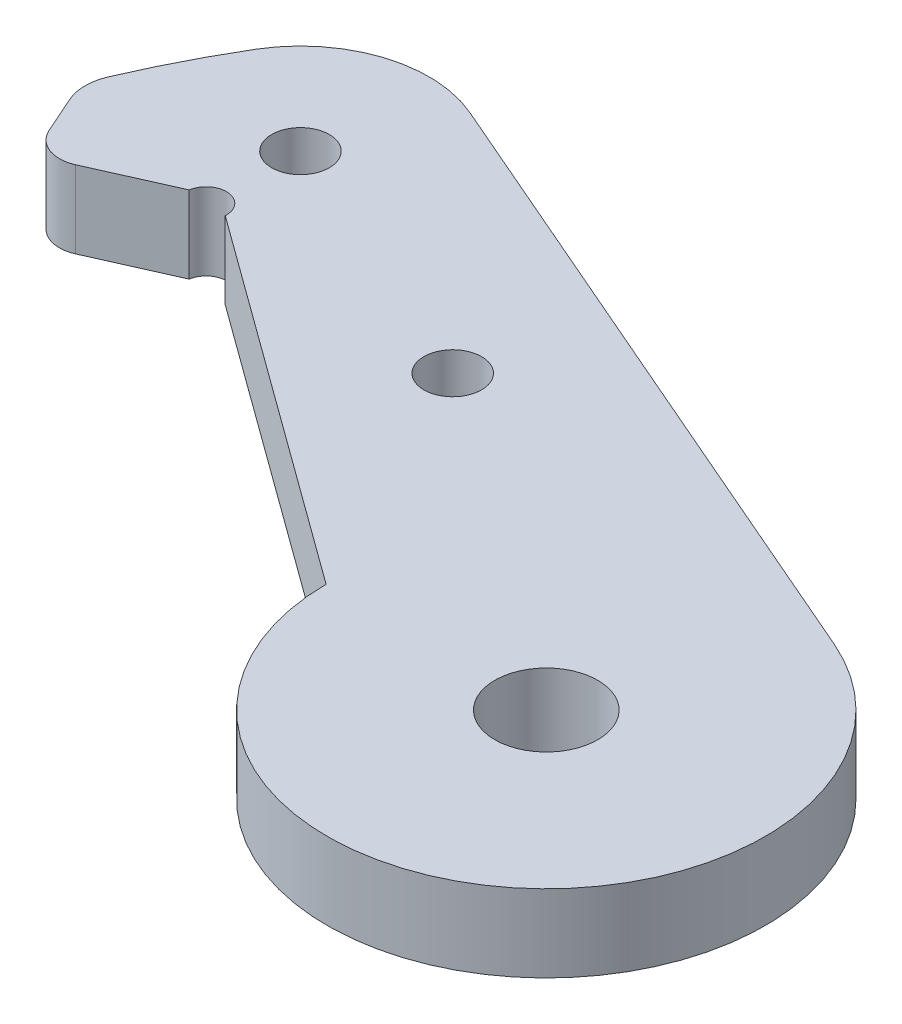
ISO-10303-21;
HEADER;
FILE_DESCRIPTION(('STEP AP214'),'2;1');
FILE_NAME('part.step','',(''),(''),'','','');
FILE_SCHEMA(('AUTOMOTIVE_DESIGN { 1 0 10303 214 1 1 1 1 }'));
ENDSEC;
DATA;
#1=APPLICATION_CONTEXT('core data for automotive mechanical design processes');
#2=APPLICATION_PROTOCOL_DEFINITION('international standard','automotive_design',2000,#1);
#3=PRODUCT_CONTEXT('',#1,'mechanical');
#4=PRODUCT('Part','Part','',(#3));
#5=PRODUCT_RELATED_PRODUCT_CATEGORY('part','',(#4));
#6=PRODUCT_DEFINITION_FORMATION('','',#4);
#7=PRODUCT_DEFINITION_CONTEXT('part definition',#1,'design');
#8=PRODUCT_DEFINITION('design','',#6,#7);
#9=PRODUCT_DEFINITION_SHAPE('','',#8);
#10=(LENGTH_UNIT() NAMED_UNIT(*) SI_UNIT(.MILLI.,.METRE.));
#11=(NAMED_UNIT(*) PLANE_ANGLE_UNIT() SI_UNIT($,.RADIAN.));
#12=(NAMED_UNIT(*) SI_UNIT($,.STERADIAN.) SOLID_ANGLE_UNIT());
#13=UNCERTAINTY_MEASURE_WITH_UNIT(LENGTH_MEASURE(1.E-05),#10,'distance_accuracy_value','');
#14=(GEOMETRIC_REPRESENTATION_CONTEXT(3) GLOBAL_UNCERTAINTY_ASSIGNED_CONTEXT((#13)) GLOBAL_UNIT_ASSIGNED_CONTEXT((#10,
#11,#12)) REPRESENTATION_CONTEXT('',''));
#15=CARTESIAN_POINT('',(0.,0.,0.));
#16=DIRECTION('',(0.,0.,1.));
#17=DIRECTION('',(1.,0.,0.));
#18=AXIS2_PLACEMENT_3D('',#15,#16,#17);
#19=CARTESIAN_POINT('',(-44.4381463641511,4.7625,-16.4261833639371));
#20=DIRECTION('',(0.,-1.,0.));
#21=DIRECTION('',(0.,0.,-1.));
#22=AXIS2_PLACEMENT_3D('',#19,#20,#21);
#23=PLANE('',#22);
#24=CARTESIAN_POINT('',(-44.4381463641511,4.7625,-16.4261833639371));
#25=DIRECTION('',(0.,1.,0.));
#26=DIRECTION('',(0.,0.,-1.));
#27=AXIS2_PLACEMENT_3D('',#24,#25,#26);
#28=CIRCLE('',#27,2.);
#29=CARTESIAN_POINT('',(-46.2655823530906,4.7625,-15.6134855687334));
#30=VERTEX_POINT('',#29);
#31=CARTESIAN_POINT('',(-43.6254485689475,4.7625,-14.5987473749976));
#32=VERTEX_POINT('',#31);
#33=EDGE_CURVE('E171',#30,#32,#28,.T.);
#34=ORIENTED_EDGE('',*,*,#33,.T.);
#35=DIRECTION('',(0.913717994469729,0.,-0.406348897601823));
#36=VECTOR('',#35,1.);
#37=CARTESIAN_POINT('',(-38.7702250311405,4.7625,-16.7579636147339));
#38=LINE('',#37,#36);
#39=CARTESIAN_POINT('',(-38.7702250311405,4.7625,-16.7579636147339));
#40=VERTEX_POINT('',#39);
#41=EDGE_CURVE('E109',#32,#40,#38,.T.);
#42=ORIENTED_EDGE('',*,*,#41,.T.);
#43=CARTESIAN_POINT('',(-37.5347907026087,4.7625,-16.5676953307629));
#44=DIRECTION('',(0.,-1.,0.));
#45=DIRECTION('',(0.,0.,-1.));
#46=AXIS2_PLACEMENT_3D('',#43,#44,#45);
#47=CIRCLE('',#46,1.25);
#48=CARTESIAN_POINT('',(-36.2868550805044,4.7625,-16.4958852821415));
#49=VERTEX_POINT('',#48);
#50=EDGE_CURVE('E192',#40,#49,#47,.T.);
#51=ORIENTED_EDGE('',*,*,#50,.T.);
#52=DIRECTION('',(0.808767465357847,0.,0.588128546304839));
#53=VECTOR('',#52,1.);
#54=CARTESIAN_POINT('',(-36.2868550805044,4.7625,-16.4958852821415));
#55=LINE('',#54,#53);
#56=CARTESIAN_POINT('',(-13.4997935259034,4.7625,0.074664301893318));
#57=VERTEX_POINT('',#56);
#58=EDGE_CURVE('E211',#49,#57,#55,.T.);
#59=ORIENTED_EDGE('',*,*,#58,.T.);
#60=CARTESIAN_POINT('',(0.,4.7625,0.));
#61=DIRECTION('',(0.,1.,0.));
#62=DIRECTION('',(0.,0.,1.));
#63=AXIS2_PLACEMENT_3D('',#60,#61,#62);
#64=CIRCLE('',#63,13.5);
#65=CARTESIAN_POINT('',(5.36363887672502,4.7625,-12.3887601478148));
#66=VERTEX_POINT('',#65);
#67=EDGE_CURVE('E208',#57,#66,#64,.T.);
#68=ORIENTED_EDGE('',*,*,#67,.T.);
#69=DIRECTION('',(-0.917685936875169,0.,-0.397306583461113));
#70=VECTOR('',#69,1.);
#71=CARTESIAN_POINT('',(-34.2596328863461,4.7625,-29.5434163293646));
#72=LINE('',#71,#70);
#73=CARTESIAN_POINT('',(-34.2596328863461,4.7625,-29.5434163293646));
#74=VERTEX_POINT('',#73);
#75=EDGE_CURVE('E210',#66,#74,#72,.T.);
#76=ORIENTED_EDGE('',*,*,#75,.T.);
#77=CARTESIAN_POINT('',(-37.4132538925687,4.7625,-22.2592842054179));
#78=DIRECTION('',(0.,1.,0.));
#79=DIRECTION('',(0.,0.,1.));
#80=AXIS2_PLACEMENT_3D('',#77,#78,#79);
#81=CIRCLE('',#80,7.93750000000001);
#82=CARTESIAN_POINT('',(-44.234733224639,4.7625,-26.3177723441387));
#83=VERTEX_POINT('',#82);
#84=EDGE_CURVE('E134',#74,#83,#81,.T.);
#85=ORIENTED_EDGE('',*,*,#84,.T.);
#86=CARTESIAN_POINT('',(0.,4.7625,0.));
#87=DIRECTION('',(0.,1.,0.));
#88=DIRECTION('',(0.,0.,-1.));
#89=AXIS2_PLACEMENT_3D('',#86,#87,#88);
#90=CIRCLE('',#89,51.4717083902691);
#91=CARTESIAN_POINT('',(-47.2982832858306,4.7625,-20.3029348328316));
#92=VERTEX_POINT('',#91);
#93=EDGE_CURVE('E128',#83,#92,#90,.T.);
#94=ORIENTED_EDGE('',*,*,#93,.T.);
#95=CARTESIAN_POINT('',(-44.5415290553004,4.7625,-19.1195895271606));
#96=DIRECTION('',(0.,1.,0.));
#97=DIRECTION('',(0.,0.,1.));
#98=AXIS2_PLACEMENT_3D('',#95,#96,#97);
#99=CIRCLE('',#98,3.);
#100=CARTESIAN_POINT('',(-47.2826830387096,4.7625,-17.9005428343551));
#101=VERTEX_POINT('',#100);
#102=EDGE_CURVE('E132',#92,#101,#99,.T.);
#103=ORIENTED_EDGE('',*,*,#102,.T.);
#104=DIRECTION('',(0.406348897601824,0.,0.913717994469728));
#105=VECTOR('',#104,1.);
#106=CARTESIAN_POINT('',(-46.2655823530906,4.7625,-15.6134855687334));
#107=LINE('',#106,#105);
#108=EDGE_CURVE('E60',#101,#30,#107,.T.);
#109=ORIENTED_EDGE('',*,*,#108,.T.);
#110=EDGE_LOOP('',(#34,#42,#51,#59,#68,#76,#85,#94,#103,#109));
#111=FACE_BOUND('',#110,.T.);
#112=CARTESIAN_POINT('',(-20.8624589223986,4.7625,-15.0937174914343));
#113=DIRECTION('',(0.,1.,0.));
#114=DIRECTION('',(0.,0.,1.));
#115=AXIS2_PLACEMENT_3D('',#112,#113,#114);
#116=CIRCLE('',#115,1.778);
#117=CARTESIAN_POINT('',(-20.8624589223986,4.7625,-13.3157174914343));
#118=VERTEX_POINT('',#117);
#119=EDGE_CURVE('E156',#118,#118,#116,.T.);
#120=ORIENTED_EDGE('',*,*,#119,.F.);
#121=EDGE_LOOP('',(#120));
#122=FACE_BOUND('',#121,.T.);
#123=CARTESIAN_POINT('',(0.,4.7625,0.));
#124=DIRECTION('',(0.,1.,0.));
#125=DIRECTION('',(0.,0.,1.));
#126=AXIS2_PLACEMENT_3D('',#123,#124,#125);
#127=CIRCLE('',#126,3.175);
#128=CARTESIAN_POINT('',(0.,4.7625,3.175));
#129=VERTEX_POINT('',#128);
#130=EDGE_CURVE('E222',#129,#129,#127,.T.);
#131=ORIENTED_EDGE('',*,*,#130,.F.);
#132=EDGE_LOOP('',(#131));
#133=FACE_BOUND('',#132,.T.);
#134=CARTESIAN_POINT('',(-37.4132538925687,4.7625,-22.2592842054179));
#135=DIRECTION('',(0.,1.,0.));
#136=DIRECTION('',(0.,0.,1.));
#137=AXIS2_PLACEMENT_3D('',#134,#135,#136);
#138=CIRCLE('',#137,1.778);
#139=CARTESIAN_POINT('',(-37.4132538925687,4.7625,-20.4812842054179));
#140=VERTEX_POINT('',#139);
#141=EDGE_CURVE('E228',#140,#140,#138,.T.);
#142=ORIENTED_EDGE('',*,*,#141,.F.);
#143=EDGE_LOOP('',(#142));
#144=FACE_BOUND('',#143,.T.);
#145=ADVANCED_FACE('F43',(#111,#122,#133,#144),#23,.F.);
#146=CARTESIAN_POINT('',(-44.4381463641511,0.,-16.4261833639371));
#147=DIRECTION('',(0.,-1.,0.));
#148=DIRECTION('',(0.,0.,-1.));
#149=AXIS2_PLACEMENT_3D('',#146,#147,#148);
#150=PLANE('',#149);
#151=CARTESIAN_POINT('',(0.,0.,0.));
#152=DIRECTION('',(0.,1.,0.));
#153=DIRECTION('',(0.,0.,1.));
#154=AXIS2_PLACEMENT_3D('',#151,#152,#153);
#155=CIRCLE('',#154,3.175);
#156=CARTESIAN_POINT('',(0.,0.,3.175));
#157=VERTEX_POINT('',#156);
#158=EDGE_CURVE('E225',#157,#157,#155,.T.);
#159=ORIENTED_EDGE('',*,*,#158,.T.);
#160=EDGE_LOOP('',(#159));
#161=FACE_BOUND('',#160,.T.);
#162=CARTESIAN_POINT('',(-44.4381463641511,0.,-16.4261833639371));
#163=DIRECTION('',(0.,1.,0.));
#164=DIRECTION('',(0.,0.,-1.));
#165=AXIS2_PLACEMENT_3D('',#162,#163,#164);
#166=CIRCLE('',#165,2.);
#167=CARTESIAN_POINT('',(-46.2655823530906,0.,-15.6134855687334));
#168=VERTEX_POINT('',#167);
#169=CARTESIAN_POINT('',(-43.6254485689475,0.,-14.5987473749976));
#170=VERTEX_POINT('',#169);
#171=EDGE_CURVE('E152',#168,#170,#166,.T.);
#172=ORIENTED_EDGE('',*,*,#171,.F.);
#173=DIRECTION('',(0.406348897601824,0.,0.913717994469728));
#174=VECTOR('',#173,1.);
#175=CARTESIAN_POINT('',(-46.2655823530906,0.,-15.6134855687334));
#176=LINE('',#175,#174);
#177=CARTESIAN_POINT('',(-47.2826830387096,0.,-17.9005428343551));
#178=VERTEX_POINT('',#177);
#179=EDGE_CURVE('E101',#178,#168,#176,.T.);
#180=ORIENTED_EDGE('',*,*,#179,.F.);
#181=CARTESIAN_POINT('',(-44.5415290553004,0.,-19.1195895271606));
#182=DIRECTION('',(0.,1.,0.));
#183=DIRECTION('',(0.,0.,1.));
#184=AXIS2_PLACEMENT_3D('',#181,#182,#183);
#185=CIRCLE('',#184,3.);
#186=CARTESIAN_POINT('',(-47.2982832858306,0.,-20.3029348328316));
#187=VERTEX_POINT('',#186);
#188=EDGE_CURVE('E95',#187,#178,#185,.T.);
#189=ORIENTED_EDGE('',*,*,#188,.F.);
#190=CARTESIAN_POINT('',(0.,0.,0.));
#191=DIRECTION('',(0.,1.,0.));
#192=DIRECTION('',(0.,0.,-1.));
#193=AXIS2_PLACEMENT_3D('',#190,#191,#192);
#194=CIRCLE('',#193,51.4717083902691);
#195=CARTESIAN_POINT('',(-44.234733224639,0.,-26.3177723441387));
#196=VERTEX_POINT('',#195);
#197=EDGE_CURVE('E142',#196,#187,#194,.T.);
#198=ORIENTED_EDGE('',*,*,#197,.F.);
#199=CARTESIAN_POINT('',(-37.4132538925687,0.,-22.2592842054179));
#200=DIRECTION('',(0.,1.,0.));
#201=DIRECTION('',(0.,0.,1.));
#202=AXIS2_PLACEMENT_3D('',#199,#200,#201);
#203=CIRCLE('',#202,7.93750000000001);
#204=CARTESIAN_POINT('',(-34.2596328863461,0.,-29.5434163293646));
#205=VERTEX_POINT('',#204);
#206=EDGE_CURVE('E166',#205,#196,#203,.T.);
#207=ORIENTED_EDGE('',*,*,#206,.F.);
#208=DIRECTION('',(-0.917685936875169,0.,-0.397306583461113));
#209=VECTOR('',#208,1.);
#210=CARTESIAN_POINT('',(-34.2596328863461,0.,-29.5434163293646));
#211=LINE('',#210,#209);
#212=CARTESIAN_POINT('',(5.36363887672502,0.,-12.3887601478148));
#213=VERTEX_POINT('',#212);
#214=EDGE_CURVE('E164',#213,#205,#211,.T.);
#215=ORIENTED_EDGE('',*,*,#214,.F.);
#216=CARTESIAN_POINT('',(0.,0.,0.));
#217=DIRECTION('',(0.,1.,0.));
#218=DIRECTION('',(0.,0.,1.));
#219=AXIS2_PLACEMENT_3D('',#216,#217,#218);
#220=CIRCLE('',#219,13.5);
#221=CARTESIAN_POINT('',(-13.4997935259034,0.,0.074664301893318));
#222=VERTEX_POINT('',#221);
#223=EDGE_CURVE('E162',#222,#213,#220,.T.);
#224=ORIENTED_EDGE('',*,*,#223,.F.);
#225=DIRECTION('',(0.808767465357847,0.,0.588128546304839));
#226=VECTOR('',#225,1.);
#227=CARTESIAN_POINT('',(-36.2868550805044,0.,-16.4958852821415));
#228=LINE('',#227,#226);
#229=CARTESIAN_POINT('',(-36.2868550805044,0.,-16.4958852821415));
#230=VERTEX_POINT('',#229);
#231=EDGE_CURVE('E160',#230,#222,#228,.T.);
#232=ORIENTED_EDGE('',*,*,#231,.F.);
#233=CARTESIAN_POINT('',(-37.5347907026087,0.,-16.5676953307629));
#234=DIRECTION('',(0.,-1.,0.));
#235=DIRECTION('',(0.,0.,-1.));
#236=AXIS2_PLACEMENT_3D('',#233,#234,#235);
#237=CIRCLE('',#236,1.25);
#238=CARTESIAN_POINT('',(-38.7702250311405,0.,-16.7579636147339));
#239=VERTEX_POINT('',#238);
#240=EDGE_CURVE('E158',#239,#230,#237,.T.);
#241=ORIENTED_EDGE('',*,*,#240,.F.);
#242=DIRECTION('',(0.913717994469729,0.,-0.406348897601823));
#243=VECTOR('',#242,1.);
#244=CARTESIAN_POINT('',(-38.7702250311405,0.,-16.7579636147339));
#245=LINE('',#244,#243);
#246=EDGE_CURVE('E155',#170,#239,#245,.T.);
#247=ORIENTED_EDGE('',*,*,#246,.F.);
#248=EDGE_LOOP('',(#172,#180,#189,#198,#207,#215,#224,#232,#241,#247));
#249=FACE_BOUND('',#248,.T.);
#250=CARTESIAN_POINT('',(-20.8624589223986,0.,-15.0937174914343));
#251=DIRECTION('',(0.,1.,0.));
#252=DIRECTION('',(0.,0.,1.));
#253=AXIS2_PLACEMENT_3D('',#250,#251,#252);
#254=CIRCLE('',#253,1.778);
#255=CARTESIAN_POINT('',(-20.8624589223986,0.,-13.3157174914343));
#256=VERTEX_POINT('',#255);
#257=EDGE_CURVE('E219',#256,#256,#254,.T.);
#258=ORIENTED_EDGE('',*,*,#257,.T.);
#259=EDGE_LOOP('',(#258));
#260=FACE_BOUND('',#259,.T.);
#261=CARTESIAN_POINT('',(-37.4132538925687,0.,-22.2592842054179));
#262=DIRECTION('',(0.,1.,0.));
#263=DIRECTION('',(0.,0.,1.));
#264=AXIS2_PLACEMENT_3D('',#261,#262,#263);
#265=CIRCLE('',#264,1.778);
#266=CARTESIAN_POINT('',(-37.4132538925687,0.,-20.4812842054179));
#267=VERTEX_POINT('',#266);
#268=EDGE_CURVE('E231',#267,#267,#265,.T.);
#269=ORIENTED_EDGE('',*,*,#268,.T.);
#270=EDGE_LOOP('',(#269));
#271=FACE_BOUND('',#270,.T.);
#272=ADVANCED_FACE('F196',(#161,#249,#260,#271),#150,.T.);
#273=CARTESIAN_POINT('',(-44.4381463641511,4.7625,-16.4261833639371));
#274=DIRECTION('',(0.,-1.,0.));
#275=DIRECTION('',(0.,0.,-1.));
#276=AXIS2_PLACEMENT_3D('',#273,#274,#275);
#277=CYLINDRICAL_SURFACE('',#276,2.);
#278=ORIENTED_EDGE('',*,*,#171,.T.);
#279=DIRECTION('',(0.,-1.,0.));
#280=VECTOR('',#279,1.);
#281=CARTESIAN_POINT('',(-43.6254485689475,4.7625,-14.5987473749976));
#282=LINE('',#281,#280);
#283=EDGE_CURVE('E13',#32,#170,#282,.T.);
#284=ORIENTED_EDGE('',*,*,#283,.F.);
#285=ORIENTED_EDGE('',*,*,#33,.F.);
#286=DIRECTION('',(0.,-1.,0.));
#287=VECTOR('',#286,1.);
#288=CARTESIAN_POINT('',(-46.2655823530906,4.7625,-15.6134855687334));
#289=LINE('',#288,#287);
#290=EDGE_CURVE('E148',#30,#168,#289,.T.);
#291=ORIENTED_EDGE('',*,*,#290,.T.);
#292=EDGE_LOOP('',(#278,#284,#285,#291));
#293=FACE_BOUND('',#292,.T.);
#294=ADVANCED_FACE('F45',(#293),#277,.T.);
#295=CARTESIAN_POINT('',(-38.7702250311405,4.7625,-16.7579636147339));
#296=DIRECTION('',(-0.406348897601823,0.,-0.913717994469729));
#297=DIRECTION('',(-0.913717994469729,0.,0.406348897601823));
#298=AXIS2_PLACEMENT_3D('',#295,#296,#297);
#299=PLANE('',#298);
#300=ORIENTED_EDGE('',*,*,#246,.T.);
#301=DIRECTION('',(0.,-1.,0.));
#302=VECTOR('',#301,1.);
#303=CARTESIAN_POINT('',(-38.7702250311405,4.7625,-16.7579636147339));
#304=LINE('',#303,#302);
#305=EDGE_CURVE('E52',#40,#239,#304,.T.);
#306=ORIENTED_EDGE('',*,*,#305,.F.);
#307=ORIENTED_EDGE('',*,*,#41,.F.);
#308=ORIENTED_EDGE('',*,*,#283,.T.);
#309=EDGE_LOOP('',(#300,#306,#307,#308));
#310=FACE_BOUND('',#309,.T.);
#311=ADVANCED_FACE('F271',(#310),#299,.F.);
#312=CARTESIAN_POINT('',(-37.5347907026087,4.7625,-16.5676953307629));
#313=DIRECTION('',(0.,-1.,0.));
#314=DIRECTION('',(0.,0.,-1.));
#315=AXIS2_PLACEMENT_3D('',#312,#313,#314);
#316=CYLINDRICAL_SURFACE('',#315,1.25);
#317=ORIENTED_EDGE('',*,*,#240,.T.);
#318=DIRECTION('',(0.,-1.,0.));
#319=VECTOR('',#318,1.);
#320=CARTESIAN_POINT('',(-36.2868550805044,4.7625,-16.4958852821415));
#321=LINE('',#320,#319);
#322=EDGE_CURVE('E184',#49,#230,#321,.T.);
#323=ORIENTED_EDGE('',*,*,#322,.F.);
#324=ORIENTED_EDGE('',*,*,#50,.F.);
#325=ORIENTED_EDGE('',*,*,#305,.T.);
#326=EDGE_LOOP('',(#317,#323,#324,#325));
#327=FACE_BOUND('',#326,.T.);
#328=ADVANCED_FACE('F190',(#327),#316,.F.);
#329=CARTESIAN_POINT('',(-36.2868550805044,4.7625,-16.4958852821415));
#330=DIRECTION('',(0.588128546304839,0.,-0.808767465357847));
#331=DIRECTION('',(-0.808767465357847,0.,-0.588128546304839));
#332=AXIS2_PLACEMENT_3D('',#329,#330,#331);
#333=PLANE('',#332);
#334=ORIENTED_EDGE('',*,*,#231,.T.);
#335=DIRECTION('',(0.,-1.,0.));
#336=VECTOR('',#335,1.);
#337=CARTESIAN_POINT('',(-13.4997935259034,4.7625,0.074664301893318));
#338=LINE('',#337,#336);
#339=EDGE_CURVE('E181',#57,#222,#338,.T.);
#340=ORIENTED_EDGE('',*,*,#339,.F.);
#341=ORIENTED_EDGE('',*,*,#58,.F.);
#342=ORIENTED_EDGE('',*,*,#322,.T.);
#343=EDGE_LOOP('',(#334,#340,#341,#342));
#344=FACE_BOUND('',#343,.T.);
#345=ADVANCED_FACE('F202',(#344),#333,.F.);
#346=CARTESIAN_POINT('',(0.,4.7625,0.));
#347=DIRECTION('',(0.,-1.,0.));
#348=DIRECTION('',(0.,0.,-1.));
#349=AXIS2_PLACEMENT_3D('',#346,#347,#348);
#350=CYLINDRICAL_SURFACE('',#349,13.5);
#351=ORIENTED_EDGE('',*,*,#223,.T.);
#352=DIRECTION('',(0.,-1.,0.));
#353=VECTOR('',#352,1.);
#354=CARTESIAN_POINT('',(5.36363887672502,4.7625,-12.3887601478148));
#355=LINE('',#354,#353);
#356=EDGE_CURVE('E178',#66,#213,#355,.T.);
#357=ORIENTED_EDGE('',*,*,#356,.F.);
#358=ORIENTED_EDGE('',*,*,#67,.F.);
#359=ORIENTED_EDGE('',*,*,#339,.T.);
#360=EDGE_LOOP('',(#351,#357,#358,#359));
#361=FACE_BOUND('',#360,.T.);
#362=ADVANCED_FACE('F206',(#361),#350,.T.);
#363=CARTESIAN_POINT('',(-34.2596328863461,4.7625,-29.5434163293646));
#364=DIRECTION('',(-0.397306583461113,0.,0.91768593687517));
#365=DIRECTION('',(0.917685936875169,0.,0.397306583461113));
#366=AXIS2_PLACEMENT_3D('',#363,#364,#365);
#367=PLANE('',#366);
#368=ORIENTED_EDGE('',*,*,#214,.T.);
#369=DIRECTION('',(0.,-1.,0.));
#370=VECTOR('',#369,1.);
#371=CARTESIAN_POINT('',(-34.2596328863461,4.7625,-29.5434163293646));
#372=LINE('',#371,#370);
#373=EDGE_CURVE('E175',#74,#205,#372,.T.);
#374=ORIENTED_EDGE('',*,*,#373,.F.);
#375=ORIENTED_EDGE('',*,*,#75,.F.);
#376=ORIENTED_EDGE('',*,*,#356,.T.);
#377=EDGE_LOOP('',(#368,#374,#375,#376));
#378=FACE_BOUND('',#377,.T.);
#379=ADVANCED_FACE('F261',(#378),#367,.F.);
#380=CARTESIAN_POINT('',(-37.4132538925687,4.7625,-22.2592842054179));
#381=DIRECTION('',(0.,-1.,0.));
#382=DIRECTION('',(0.,0.,-1.));
#383=AXIS2_PLACEMENT_3D('',#380,#381,#382);
#384=CYLINDRICAL_SURFACE('',#383,7.93750000000001);
#385=ORIENTED_EDGE('',*,*,#206,.T.);
#386=DIRECTION('',(0.,-1.,0.));
#387=VECTOR('',#386,1.);
#388=CARTESIAN_POINT('',(-44.234733224639,4.7625,-26.3177723441387));
#389=LINE('',#388,#387);
#390=EDGE_CURVE('E143',#83,#196,#389,.T.);
#391=ORIENTED_EDGE('',*,*,#390,.F.);
#392=ORIENTED_EDGE('',*,*,#84,.F.);
#393=ORIENTED_EDGE('',*,*,#373,.T.);
#394=EDGE_LOOP('',(#385,#391,#392,#393));
#395=FACE_BOUND('',#394,.T.);
#396=ADVANCED_FACE('F258',(#395),#384,.T.);
#397=CARTESIAN_POINT('',(0.,4.7625,0.));
#398=DIRECTION('',(0.,-1.,0.));
#399=DIRECTION('',(0.,0.,-1.));
#400=AXIS2_PLACEMENT_3D('',#397,#398,#399);
#401=CYLINDRICAL_SURFACE('',#400,51.4717083902691);
#402=ORIENTED_EDGE('',*,*,#197,.T.);
#403=DIRECTION('',(0.,-1.,0.));
#404=VECTOR('',#403,1.);
#405=CARTESIAN_POINT('',(-47.2982832858306,4.7625,-20.3029348328316));
#406=LINE('',#405,#404);
#407=EDGE_CURVE('E139',#92,#187,#406,.T.);
#408=ORIENTED_EDGE('',*,*,#407,.F.);
#409=ORIENTED_EDGE('',*,*,#93,.F.);
#410=ORIENTED_EDGE('',*,*,#390,.T.);
#411=EDGE_LOOP('',(#402,#408,#409,#410));
#412=FACE_BOUND('',#411,.T.);
#413=ADVANCED_FACE('F140',(#412),#401,.T.);
#414=CARTESIAN_POINT('',(-44.5415290553004,4.7625,-19.1195895271606));
#415=DIRECTION('',(0.,-1.,0.));
#416=DIRECTION('',(0.,0.,-1.));
#417=AXIS2_PLACEMENT_3D('',#414,#415,#416);
#418=CYLINDRICAL_SURFACE('',#417,3.);
#419=ORIENTED_EDGE('',*,*,#188,.T.);
#420=DIRECTION('',(0.,-1.,0.));
#421=VECTOR('',#420,1.);
#422=CARTESIAN_POINT('',(-47.2826830387096,4.7625,-17.9005428343551));
#423=LINE('',#422,#421);
#424=EDGE_CURVE('E144',#101,#178,#423,.T.);
#425=ORIENTED_EDGE('',*,*,#424,.F.);
#426=ORIENTED_EDGE('',*,*,#102,.F.);
#427=ORIENTED_EDGE('',*,*,#407,.T.);
#428=EDGE_LOOP('',(#419,#425,#426,#427));
#429=FACE_BOUND('',#428,.T.);
#430=ADVANCED_FACE('F146',(#429),#418,.T.);
#431=CARTESIAN_POINT('',(-46.2655823530906,4.7625,-15.6134855687334));
#432=DIRECTION('',(0.913717994469728,0.,-0.406348897601824));
#433=DIRECTION('',(-0.406348897601824,0.,-0.913717994469729));
#434=AXIS2_PLACEMENT_3D('',#431,#432,#433);
#435=PLANE('',#434);
#436=ORIENTED_EDGE('',*,*,#179,.T.);
#437=ORIENTED_EDGE('',*,*,#290,.F.);
#438=ORIENTED_EDGE('',*,*,#108,.F.);
#439=ORIENTED_EDGE('',*,*,#424,.T.);
#440=EDGE_LOOP('',(#436,#437,#438,#439));
#441=FACE_BOUND('',#440,.T.);
#442=ADVANCED_FACE('F251',(#441),#435,.F.);
#443=CARTESIAN_POINT('',(-20.8624589223986,4.7625,-15.0937174914343));
#444=DIRECTION('',(0.,-1.,0.));
#445=DIRECTION('',(0.,0.,-1.));
#446=AXIS2_PLACEMENT_3D('',#443,#444,#445);
#447=CYLINDRICAL_SURFACE('',#446,1.778);
#448=ORIENTED_EDGE('',*,*,#119,.T.);
#449=EDGE_LOOP('',(#448));
#450=FACE_BOUND('',#449,.T.);
#451=ORIENTED_EDGE('',*,*,#257,.F.);
#452=EDGE_LOOP('',(#451));
#453=FACE_BOUND('',#452,.T.);
#454=ADVANCED_FACE('F248',(#450,#453),#447,.F.);
#455=CARTESIAN_POINT('',(0.,4.7625,0.));
#456=DIRECTION('',(0.,-1.,0.));
#457=DIRECTION('',(0.,0.,-1.));
#458=AXIS2_PLACEMENT_3D('',#455,#456,#457);
#459=CYLINDRICAL_SURFACE('',#458,3.175);
#460=ORIENTED_EDGE('',*,*,#130,.T.);
#461=EDGE_LOOP('',(#460));
#462=FACE_BOUND('',#461,.T.);
#463=ORIENTED_EDGE('',*,*,#158,.F.);
#464=EDGE_LOOP('',(#463));
#465=FACE_BOUND('',#464,.T.);
#466=ADVANCED_FACE('F347',(#462,#465),#459,.F.);
#467=CARTESIAN_POINT('',(-37.4132538925687,4.7625,-22.2592842054179));
#468=DIRECTION('',(0.,-1.,0.));
#469=DIRECTION('',(0.,0.,-1.));
#470=AXIS2_PLACEMENT_3D('',#467,#468,#469);
#471=CYLINDRICAL_SURFACE('',#470,1.778);
#472=ORIENTED_EDGE('',*,*,#141,.T.);
#473=EDGE_LOOP('',(#472));
#474=FACE_BOUND('',#473,.T.);
#475=ORIENTED_EDGE('',*,*,#268,.F.);
#476=EDGE_LOOP('',(#475));
#477=FACE_BOUND('',#476,.T.);
#478=ADVANCED_FACE('F237',(#474,#477),#471,.F.);
#479=CLOSED_SHELL('',(#145,#272,#294,#311,#328,#345,#362,#379,#396,#413,#430,#442,#454,#466,#478));
#480=MANIFOLD_SOLID_BREP('B2',#479);
#481=ADVANCED_BREP_SHAPE_REPRESENTATION('',(#18,#480),#14);
#482=SHAPE_DEFINITION_REPRESENTATION(#9,#481);
ENDSEC;
END-ISO-10303-21;
